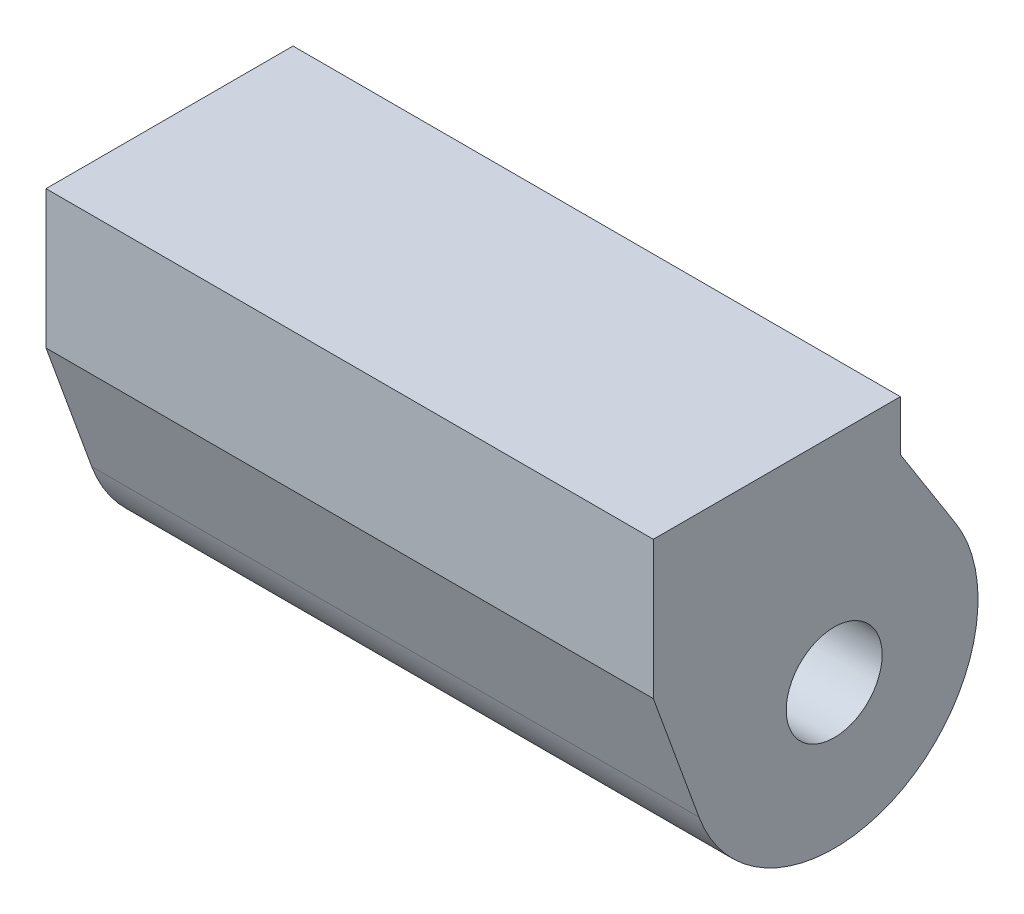
ISO-10303-21;
HEADER;
FILE_DESCRIPTION(('STEP AP214'),'2;1');
FILE_NAME('part.step','',(''),(''),'','','');
FILE_SCHEMA(('AUTOMOTIVE_DESIGN { 1 0 10303 214 1 1 1 1 }'));
ENDSEC;
DATA;
#1=APPLICATION_CONTEXT('core data for automotive mechanical design processes');
#2=APPLICATION_PROTOCOL_DEFINITION('international standard','automotive_design',2000,#1);
#3=PRODUCT_CONTEXT('',#1,'mechanical');
#4=PRODUCT('Part','Part','',(#3));
#5=PRODUCT_RELATED_PRODUCT_CATEGORY('part','',(#4));
#6=PRODUCT_DEFINITION_FORMATION('','',#4);
#7=PRODUCT_DEFINITION_CONTEXT('part definition',#1,'design');
#8=PRODUCT_DEFINITION('design','',#6,#7);
#9=PRODUCT_DEFINITION_SHAPE('','',#8);
#10=(LENGTH_UNIT() NAMED_UNIT(*) SI_UNIT(.MILLI.,.METRE.));
#11=(NAMED_UNIT(*) PLANE_ANGLE_UNIT() SI_UNIT($,.RADIAN.));
#12=(NAMED_UNIT(*) SI_UNIT($,.STERADIAN.) SOLID_ANGLE_UNIT());
#13=UNCERTAINTY_MEASURE_WITH_UNIT(LENGTH_MEASURE(1.E-05),#10,'distance_accuracy_value','');
#14=(GEOMETRIC_REPRESENTATION_CONTEXT(3) GLOBAL_UNCERTAINTY_ASSIGNED_CONTEXT((#13)) GLOBAL_UNIT_ASSIGNED_CONTEXT((#10,
#11,#12)) REPRESENTATION_CONTEXT('',''));
#15=CARTESIAN_POINT('',(0.,0.,0.));
#16=DIRECTION('',(0.,0.,1.));
#17=DIRECTION('',(1.,0.,0.));
#18=AXIS2_PLACEMENT_3D('',#15,#16,#17);
#19=CARTESIAN_POINT('',(9.5,-16.0287039880252,21.6303394918166));
#20=DIRECTION('',(0.,-0.342020143325669,0.939692620785908));
#21=DIRECTION('',(-1.,0.,0.));
#22=AXIS2_PLACEMENT_3D('',#19,#20,#21);
#23=PLANE('',#22);
#24=DIRECTION('',(1.,0.,0.));
#25=VECTOR('',#24,1.);
#26=CARTESIAN_POINT('',(9.5,-20.4550780676246,20.0192710811149));
#27=LINE('',#26,#25);
#28=CARTESIAN_POINT('',(-9.5,-20.4550780676246,20.0192710811149));
#29=VERTEX_POINT('',#28);
#30=CARTESIAN_POINT('',(9.5,-20.4550780676246,20.0192710811149));
#31=VERTEX_POINT('',#30);
#32=EDGE_CURVE('E101',#29,#31,#27,.T.);
#33=ORIENTED_EDGE('',*,*,#32,.F.);
#34=DIRECTION('',(0.,0.939692620785908,0.342020143325669));
#35=VECTOR('',#34,1.);
#36=CARTESIAN_POINT('',(-9.5,-16.0287039880252,21.6303394918166));
#37=LINE('',#36,#35);
#38=CARTESIAN_POINT('',(-9.5,-24.3843421306709,18.5891359195942));
#39=VERTEX_POINT('',#38);
#40=EDGE_CURVE('E111',#39,#29,#37,.T.);
#41=ORIENTED_EDGE('',*,*,#40,.F.);
#42=DIRECTION('',(-1.,0.,0.));
#43=VECTOR('',#42,1.);
#44=CARTESIAN_POINT('',(9.5,-24.3843421306709,18.5891359195942));
#45=LINE('',#44,#43);
#46=CARTESIAN_POINT('',(9.5,-24.3843421306709,18.5891359195942));
#47=VERTEX_POINT('',#46);
#48=EDGE_CURVE('E142',#47,#39,#45,.T.);
#49=ORIENTED_EDGE('',*,*,#48,.F.);
#50=DIRECTION('',(0.,0.939692620785908,0.342020143325669));
#51=VECTOR('',#50,1.);
#52=CARTESIAN_POINT('',(9.5,-16.0287039880252,21.6303394918166));
#53=LINE('',#52,#51);
#54=EDGE_CURVE('E11',#47,#31,#53,.T.);
#55=ORIENTED_EDGE('',*,*,#54,.T.);
#56=EDGE_LOOP('',(#33,#41,#49,#55));
#57=FACE_BOUND('',#56,.T.);
#58=ADVANCED_FACE('F41',(#57),#23,.T.);
#59=CARTESIAN_POINT('',(9.5,-22.8452514857054,14.3605191260576));
#60=DIRECTION('',(-1.,0.,0.));
#61=DIRECTION('',(0.,0.,1.));
#62=AXIS2_PLACEMENT_3D('',#59,#60,#61);
#63=CYLINDRICAL_SURFACE('',#62,4.5);
#64=CARTESIAN_POINT('',(-9.5,-22.8452514857054,14.3605191260576));
#65=DIRECTION('',(1.,0.,0.));
#66=DIRECTION('',(0.,0.,-1.));
#67=AXIS2_PLACEMENT_3D('',#64,#65,#66);
#68=CIRCLE('',#67,4.5);
#69=CARTESIAN_POINT('',(-9.5,-20.4343265102656,10.5608558827161));
#70=VERTEX_POINT('',#69);
#71=EDGE_CURVE('E50',#39,#70,#68,.T.);
#72=ORIENTED_EDGE('',*,*,#71,.T.);
#73=DIRECTION('',(-1.,0.,0.));
#74=VECTOR('',#73,1.);
#75=CARTESIAN_POINT('',(9.5,-20.4343265102656,10.5608558827161));
#76=LINE('',#75,#74);
#77=CARTESIAN_POINT('',(9.5,-20.4343265102656,10.5608558827161));
#78=VERTEX_POINT('',#77);
#79=EDGE_CURVE('E133',#78,#70,#76,.T.);
#80=ORIENTED_EDGE('',*,*,#79,.F.);
#81=CARTESIAN_POINT('',(9.5,-22.8452514857054,14.3605191260576));
#82=DIRECTION('',(1.,0.,0.));
#83=DIRECTION('',(0.,0.,-1.));
#84=AXIS2_PLACEMENT_3D('',#81,#82,#83);
#85=CIRCLE('',#84,4.5);
#86=EDGE_CURVE('E136',#47,#78,#85,.T.);
#87=ORIENTED_EDGE('',*,*,#86,.F.);
#88=ORIENTED_EDGE('',*,*,#48,.T.);
#89=EDGE_LOOP('',(#72,#80,#87,#88));
#90=FACE_BOUND('',#89,.T.);
#91=ADVANCED_FACE('F156',(#90),#63,.T.);
#92=CARTESIAN_POINT('',(9.5,-14.0536961778226,14.6094307279982));
#93=DIRECTION('',(0.,0.535761105653282,-0.844369609631453));
#94=DIRECTION('',(-1.,0.,0.));
#95=AXIS2_PLACEMENT_3D('',#92,#93,#94);
#96=PLANE('',#95);
#97=DIRECTION('',(-1.,0.,0.));
#98=VECTOR('',#97,1.);
#99=CARTESIAN_POINT('',(9.5,-17.70760064817,12.2909911765804));
#100=LINE('',#99,#98);
#101=CARTESIAN_POINT('',(9.5,-17.70760064817,12.2909911765804));
#102=VERTEX_POINT('',#101);
#103=CARTESIAN_POINT('',(-9.5,-17.70760064817,12.2909911765804));
#104=VERTEX_POINT('',#103);
#105=EDGE_CURVE('E66',#102,#104,#100,.T.);
#106=ORIENTED_EDGE('',*,*,#105,.F.);
#107=DIRECTION('',(0.,-0.844369609631453,-0.535761105653282));
#108=VECTOR('',#107,1.);
#109=CARTESIAN_POINT('',(9.5,-14.0536961778226,14.6094307279982));
#110=LINE('',#109,#108);
#111=EDGE_CURVE('E45',#102,#78,#110,.T.);
#112=ORIENTED_EDGE('',*,*,#111,.T.);
#113=ORIENTED_EDGE('',*,*,#79,.T.);
#114=DIRECTION('',(0.,-0.844369609631453,-0.535761105653282));
#115=VECTOR('',#114,1.);
#116=CARTESIAN_POINT('',(-9.5,-14.0536961778226,14.6094307279982));
#117=LINE('',#116,#115);
#118=EDGE_CURVE('E139',#104,#70,#117,.T.);
#119=ORIENTED_EDGE('',*,*,#118,.F.);
#120=EDGE_LOOP('',(#106,#112,#113,#119));
#121=FACE_BOUND('',#120,.T.);
#122=ADVANCED_FACE('F43',(#121),#96,.T.);
#123=CARTESIAN_POINT('',(9.5,1.73141540514422,17.5374143015117));
#124=DIRECTION('',(1.,0.,0.));
#125=DIRECTION('',(0.,1.,0.));
#126=AXIS2_PLACEMENT_3D('',#123,#124,#125);
#127=PLANE('',#126);
#128=DIRECTION('',(0.,1.,0.));
#129=VECTOR('',#128,1.);
#130=CARTESIAN_POINT('',(9.5,-16.1388385344883,20.0192710811149));
#131=LINE('',#130,#129);
#132=CARTESIAN_POINT('',(9.5,-16.1388385344883,20.0192710811149));
#133=VERTEX_POINT('',#132);
#134=EDGE_CURVE('E58',#31,#133,#131,.T.);
#135=ORIENTED_EDGE('',*,*,#134,.F.);
#136=ORIENTED_EDGE('',*,*,#54,.F.);
#137=ORIENTED_EDGE('',*,*,#86,.T.);
#138=ORIENTED_EDGE('',*,*,#111,.F.);
#139=DIRECTION('',(0.,-1.,0.));
#140=VECTOR('',#139,1.);
#141=CARTESIAN_POINT('',(9.5,4.77007989980435,12.2909911765804));
#142=LINE('',#141,#140);
#143=CARTESIAN_POINT('',(9.5,-16.1388385344883,12.2909911765804));
#144=VERTEX_POINT('',#143);
#145=EDGE_CURVE('E119',#144,#102,#142,.T.);
#146=ORIENTED_EDGE('',*,*,#145,.F.);
#147=DIRECTION('',(0.,0.,-1.));
#148=VECTOR('',#147,1.);
#149=CARTESIAN_POINT('',(9.5,-16.1388385344883,21.0192710811149));
#150=LINE('',#149,#148);
#151=EDGE_CURVE('E116',#133,#144,#150,.T.);
#152=ORIENTED_EDGE('',*,*,#151,.F.);
#153=EDGE_LOOP('',(#135,#136,#137,#138,#146,#152));
#154=FACE_BOUND('',#153,.T.);
#155=CARTESIAN_POINT('',(9.5,-22.8452514857054,14.3605191260576));
#156=DIRECTION('',(1.,0.,0.));
#157=DIRECTION('',(0.,0.,-1.));
#158=AXIS2_PLACEMENT_3D('',#155,#156,#157);
#159=CIRCLE('',#158,1.5);
#160=CARTESIAN_POINT('',(9.5,-22.8452514857054,12.8605191260576));
#161=VERTEX_POINT('',#160);
#162=EDGE_CURVE('E130',#161,#161,#159,.F.);
#163=ORIENTED_EDGE('',*,*,#162,.T.);
#164=EDGE_LOOP('',(#163));
#165=FACE_BOUND('',#164,.T.);
#166=ADVANCED_FACE('F154',(#154,#165),#127,.T.);
#167=CARTESIAN_POINT('',(-9.5,1.73141540514422,17.5374143015117));
#168=DIRECTION('',(1.,0.,0.));
#169=DIRECTION('',(0.,1.,0.));
#170=AXIS2_PLACEMENT_3D('',#167,#168,#169);
#171=PLANE('',#170);
#172=ORIENTED_EDGE('',*,*,#40,.T.);
#173=DIRECTION('',(0.,1.,0.));
#174=VECTOR('',#173,1.);
#175=CARTESIAN_POINT('',(-9.5,-16.1388385344883,20.0192710811149));
#176=LINE('',#175,#174);
#177=CARTESIAN_POINT('',(-9.5,-16.1388385344883,20.0192710811149));
#178=VERTEX_POINT('',#177);
#179=EDGE_CURVE('E96',#29,#178,#176,.T.);
#180=ORIENTED_EDGE('',*,*,#179,.T.);
#181=DIRECTION('',(0.,0.,1.));
#182=VECTOR('',#181,1.);
#183=CARTESIAN_POINT('',(-9.5,-16.1388385344883,21.0192710811149));
#184=LINE('',#183,#182);
#185=CARTESIAN_POINT('',(-9.5,-16.1388385344883,12.2909911765804));
#186=VERTEX_POINT('',#185);
#187=EDGE_CURVE('E108',#186,#178,#184,.T.);
#188=ORIENTED_EDGE('',*,*,#187,.F.);
#189=DIRECTION('',(0.,-1.,0.));
#190=VECTOR('',#189,1.);
#191=CARTESIAN_POINT('',(-9.5,4.77007989980435,12.2909911765804));
#192=LINE('',#191,#190);
#193=EDGE_CURVE('E124',#186,#104,#192,.T.);
#194=ORIENTED_EDGE('',*,*,#193,.T.);
#195=ORIENTED_EDGE('',*,*,#118,.T.);
#196=ORIENTED_EDGE('',*,*,#71,.F.);
#197=EDGE_LOOP('',(#172,#180,#188,#194,#195,#196));
#198=FACE_BOUND('',#197,.T.);
#199=CARTESIAN_POINT('',(-9.5,-22.8452514857054,14.3605191260576));
#200=DIRECTION('',(-1.,0.,0.));
#201=DIRECTION('',(0.,0.,1.));
#202=AXIS2_PLACEMENT_3D('',#199,#200,#201);
#203=CIRCLE('',#202,1.5);
#204=CARTESIAN_POINT('',(-9.5,-22.8452514857054,15.8605191260576));
#205=VERTEX_POINT('',#204);
#206=EDGE_CURVE('E127',#205,#205,#203,.T.);
#207=ORIENTED_EDGE('',*,*,#206,.F.);
#208=EDGE_LOOP('',(#207));
#209=FACE_BOUND('',#208,.T.);
#210=ADVANCED_FACE('F106',(#198,#209),#171,.F.);
#211=CARTESIAN_POINT('',(17.278174593052,-22.8452514857054,14.3605191260576));
#212=DIRECTION('',(-1.,0.,0.));
#213=DIRECTION('',(0.,0.,1.));
#214=AXIS2_PLACEMENT_3D('',#211,#212,#213);
#215=CYLINDRICAL_SURFACE('',#214,1.5);
#216=ORIENTED_EDGE('',*,*,#206,.T.);
#217=EDGE_LOOP('',(#216));
#218=FACE_BOUND('',#217,.T.);
#219=ORIENTED_EDGE('',*,*,#162,.F.);
#220=EDGE_LOOP('',(#219));
#221=FACE_BOUND('',#220,.T.);
#222=ADVANCED_FACE('F170',(#218,#221),#215,.F.);
#223=CARTESIAN_POINT('',(-9.5,4.77007989980435,12.2909911765804));
#224=DIRECTION('',(0.,0.,1.));
#225=DIRECTION('',(1.,0.,0.));
#226=AXIS2_PLACEMENT_3D('',#223,#224,#225);
#227=PLANE('',#226);
#228=DIRECTION('',(-1.,0.,0.));
#229=VECTOR('',#228,1.);
#230=CARTESIAN_POINT('',(-9.5,-16.1388385344883,12.2909911765804));
#231=LINE('',#230,#229);
#232=EDGE_CURVE('E115',#144,#186,#231,.T.);
#233=ORIENTED_EDGE('',*,*,#232,.F.);
#234=ORIENTED_EDGE('',*,*,#145,.T.);
#235=ORIENTED_EDGE('',*,*,#105,.T.);
#236=ORIENTED_EDGE('',*,*,#193,.F.);
#237=EDGE_LOOP('',(#233,#234,#235,#236));
#238=FACE_BOUND('',#237,.T.);
#239=ADVANCED_FACE('F157',(#238),#227,.F.);
#240=CARTESIAN_POINT('',(-9.50000000000001,-16.1388385344883,39.35258838224));
#241=DIRECTION('',(0.,1.,0.));
#242=DIRECTION('',(0.,0.,1.));
#243=AXIS2_PLACEMENT_3D('',#240,#241,#242);
#244=PLANE('',#243);
#245=DIRECTION('',(1.,0.,0.));
#246=VECTOR('',#245,1.);
#247=CARTESIAN_POINT('',(-9.5,-16.1388385344883,20.0192710811149));
#248=LINE('',#247,#246);
#249=EDGE_CURVE('E93',#178,#133,#248,.T.);
#250=ORIENTED_EDGE('',*,*,#249,.T.);
#251=ORIENTED_EDGE('',*,*,#151,.T.);
#252=ORIENTED_EDGE('',*,*,#232,.T.);
#253=ORIENTED_EDGE('',*,*,#187,.T.);
#254=EDGE_LOOP('',(#250,#251,#252,#253));
#255=FACE_BOUND('',#254,.T.);
#256=ADVANCED_FACE('F113',(#255),#244,.T.);
#257=CARTESIAN_POINT('',(-9.5,-16.1388385344883,20.0192710811149));
#258=DIRECTION('',(0.,0.,-1.));
#259=DIRECTION('',(-1.,0.,0.));
#260=AXIS2_PLACEMENT_3D('',#257,#258,#259);
#261=PLANE('',#260);
#262=ORIENTED_EDGE('',*,*,#32,.T.);
#263=ORIENTED_EDGE('',*,*,#134,.T.);
#264=ORIENTED_EDGE('',*,*,#249,.F.);
#265=ORIENTED_EDGE('',*,*,#179,.F.);
#266=EDGE_LOOP('',(#262,#263,#264,#265));
#267=FACE_BOUND('',#266,.T.);
#268=ADVANCED_FACE('F95',(#267),#261,.F.);
#269=CLOSED_SHELL('',(#58,#91,#122,#166,#210,#222,#239,#256,#268));
#270=MANIFOLD_SOLID_BREP('B2',#269);
#271=ADVANCED_BREP_SHAPE_REPRESENTATION('',(#18,#270),#14);
#272=SHAPE_DEFINITION_REPRESENTATION(#9,#271);
ENDSEC;
END-ISO-10303-21;
